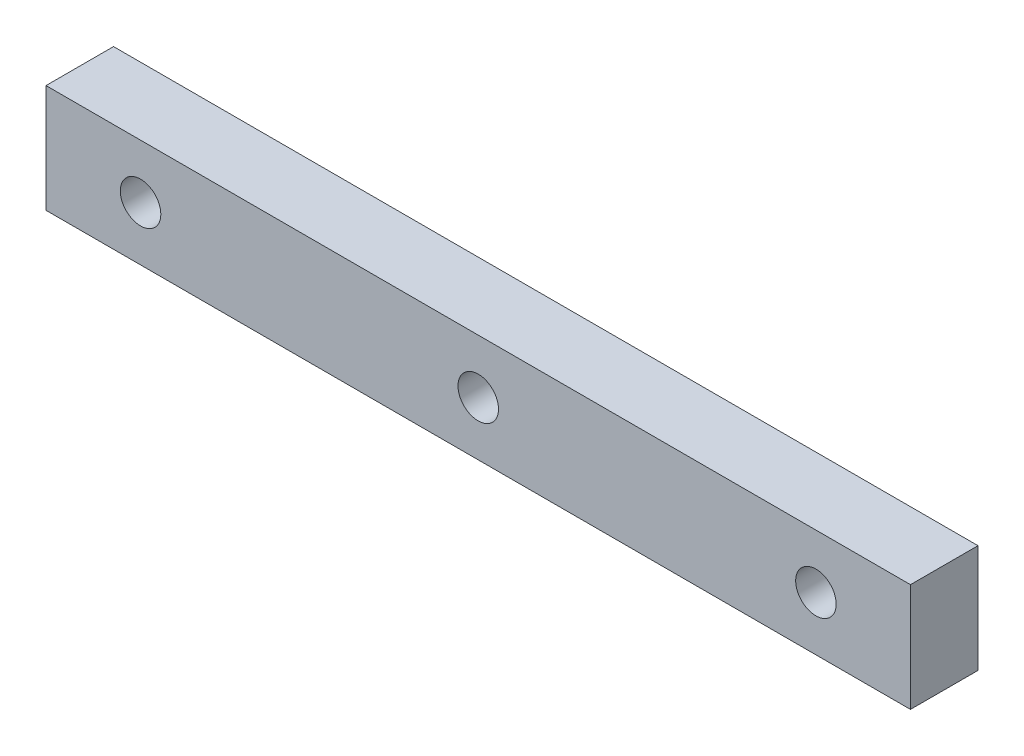
ISO-10303-21;
HEADER;
FILE_DESCRIPTION(('STEP AP214'),'2;1');
FILE_NAME('part.step','',(''),(''),'','','');
FILE_SCHEMA(('AUTOMOTIVE_DESIGN { 1 0 10303 214 1 1 1 1 }'));
ENDSEC;
DATA;
#1=APPLICATION_CONTEXT('core data for automotive mechanical design processes');
#2=APPLICATION_PROTOCOL_DEFINITION('international standard','automotive_design',2000,#1);
#3=PRODUCT_CONTEXT('',#1,'mechanical');
#4=PRODUCT('Part','Part','',(#3));
#5=PRODUCT_RELATED_PRODUCT_CATEGORY('part','',(#4));
#6=PRODUCT_DEFINITION_FORMATION('','',#4);
#7=PRODUCT_DEFINITION_CONTEXT('part definition',#1,'design');
#8=PRODUCT_DEFINITION('design','',#6,#7);
#9=PRODUCT_DEFINITION_SHAPE('','',#8);
#10=(LENGTH_UNIT() NAMED_UNIT(*) SI_UNIT(.MILLI.,.METRE.));
#11=(NAMED_UNIT(*) PLANE_ANGLE_UNIT() SI_UNIT($,.RADIAN.));
#12=(NAMED_UNIT(*) SI_UNIT($,.STERADIAN.) SOLID_ANGLE_UNIT());
#13=UNCERTAINTY_MEASURE_WITH_UNIT(LENGTH_MEASURE(1.E-05),#10,'distance_accuracy_value','');
#14=(GEOMETRIC_REPRESENTATION_CONTEXT(3) GLOBAL_UNCERTAINTY_ASSIGNED_CONTEXT((#13)) GLOBAL_UNIT_ASSIGNED_CONTEXT((#10,
#11,#12)) REPRESENTATION_CONTEXT('',''));
#15=CARTESIAN_POINT('',(0.,0.,0.));
#16=DIRECTION('',(0.,0.,1.));
#17=DIRECTION('',(1.,0.,0.));
#18=AXIS2_PLACEMENT_3D('',#15,#16,#17);
#19=CARTESIAN_POINT('',(-32.,4.,5.));
#20=DIRECTION('',(1.,0.,0.));
#21=DIRECTION('',(0.,0.,-1.));
#22=AXIS2_PLACEMENT_3D('',#19,#20,#21);
#23=PLANE('',#22);
#24=DIRECTION('',(0.,-1.,0.));
#25=VECTOR('',#24,1.);
#26=CARTESIAN_POINT('',(-32.,4.,0.));
#27=LINE('',#26,#25);
#28=CARTESIAN_POINT('',(-32.,4.,0.));
#29=VERTEX_POINT('',#28);
#30=CARTESIAN_POINT('',(-32.,-4.,0.));
#31=VERTEX_POINT('',#30);
#32=EDGE_CURVE('E95',#29,#31,#27,.T.);
#33=ORIENTED_EDGE('',*,*,#32,.T.);
#34=DIRECTION('',(0.,0.,-1.));
#35=VECTOR('',#34,1.);
#36=CARTESIAN_POINT('',(-32.,-4.,5.));
#37=LINE('',#36,#35);
#38=CARTESIAN_POINT('',(-32.,-4.,5.));
#39=VERTEX_POINT('',#38);
#40=EDGE_CURVE('E11',#39,#31,#37,.T.);
#41=ORIENTED_EDGE('',*,*,#40,.F.);
#42=DIRECTION('',(0.,-1.,0.));
#43=VECTOR('',#42,1.);
#44=CARTESIAN_POINT('',(-32.,4.,5.));
#45=LINE('',#44,#43);
#46=CARTESIAN_POINT('',(-32.,4.,5.));
#47=VERTEX_POINT('',#46);
#48=EDGE_CURVE('E83',#47,#39,#45,.T.);
#49=ORIENTED_EDGE('',*,*,#48,.F.);
#50=DIRECTION('',(0.,0.,-1.));
#51=VECTOR('',#50,1.);
#52=CARTESIAN_POINT('',(-32.,4.,5.));
#53=LINE('',#52,#51);
#54=EDGE_CURVE('E91',#47,#29,#53,.T.);
#55=ORIENTED_EDGE('',*,*,#54,.T.);
#56=EDGE_LOOP('',(#33,#41,#49,#55));
#57=FACE_BOUND('',#56,.T.);
#58=ADVANCED_FACE('F32',(#57),#23,.F.);
#59=CARTESIAN_POINT('',(-32.,-4.,5.));
#60=DIRECTION('',(0.,1.,0.));
#61=DIRECTION('',(0.,0.,1.));
#62=AXIS2_PLACEMENT_3D('',#59,#60,#61);
#63=PLANE('',#62);
#64=DIRECTION('',(1.,0.,0.));
#65=VECTOR('',#64,1.);
#66=CARTESIAN_POINT('',(-32.,-4.,0.));
#67=LINE('',#66,#65);
#68=CARTESIAN_POINT('',(32.,-4.,0.));
#69=VERTEX_POINT('',#68);
#70=EDGE_CURVE('E87',#31,#69,#67,.T.);
#71=ORIENTED_EDGE('',*,*,#70,.T.);
#72=DIRECTION('',(0.,0.,-1.));
#73=VECTOR('',#72,1.);
#74=CARTESIAN_POINT('',(32.,-4.,5.));
#75=LINE('',#74,#73);
#76=CARTESIAN_POINT('',(32.,-4.,5.));
#77=VERTEX_POINT('',#76);
#78=EDGE_CURVE('E40',#77,#69,#75,.T.);
#79=ORIENTED_EDGE('',*,*,#78,.F.);
#80=DIRECTION('',(1.,0.,0.));
#81=VECTOR('',#80,1.);
#82=CARTESIAN_POINT('',(-32.,-4.,5.));
#83=LINE('',#82,#81);
#84=EDGE_CURVE('E78',#39,#77,#83,.T.);
#85=ORIENTED_EDGE('',*,*,#84,.F.);
#86=ORIENTED_EDGE('',*,*,#40,.T.);
#87=EDGE_LOOP('',(#71,#79,#85,#86));
#88=FACE_BOUND('',#87,.T.);
#89=ADVANCED_FACE('F86',(#88),#63,.F.);
#90=CARTESIAN_POINT('',(32.,4.,5.));
#91=DIRECTION('',(-1.,0.,0.));
#92=DIRECTION('',(0.,0.,1.));
#93=AXIS2_PLACEMENT_3D('',#90,#91,#92);
#94=PLANE('',#93);
#95=DIRECTION('',(0.,1.,0.));
#96=VECTOR('',#95,1.);
#97=CARTESIAN_POINT('',(32.,4.,0.));
#98=LINE('',#97,#96);
#99=CARTESIAN_POINT('',(32.,4.,0.));
#100=VERTEX_POINT('',#99);
#101=EDGE_CURVE('E65',#69,#100,#98,.T.);
#102=ORIENTED_EDGE('',*,*,#101,.T.);
#103=DIRECTION('',(0.,0.,-1.));
#104=VECTOR('',#103,1.);
#105=CARTESIAN_POINT('',(32.,4.,5.));
#106=LINE('',#105,#104);
#107=CARTESIAN_POINT('',(32.,4.,5.));
#108=VERTEX_POINT('',#107);
#109=EDGE_CURVE('E88',#108,#100,#106,.T.);
#110=ORIENTED_EDGE('',*,*,#109,.F.);
#111=DIRECTION('',(0.,1.,0.));
#112=VECTOR('',#111,1.);
#113=CARTESIAN_POINT('',(32.,4.,5.));
#114=LINE('',#113,#112);
#115=EDGE_CURVE('E81',#77,#108,#114,.T.);
#116=ORIENTED_EDGE('',*,*,#115,.F.);
#117=ORIENTED_EDGE('',*,*,#78,.T.);
#118=EDGE_LOOP('',(#102,#110,#116,#117));
#119=FACE_BOUND('',#118,.T.);
#120=ADVANCED_FACE('F89',(#119),#94,.F.);
#121=CARTESIAN_POINT('',(-32.,4.,5.));
#122=DIRECTION('',(0.,-1.,0.));
#123=DIRECTION('',(0.,0.,-1.));
#124=AXIS2_PLACEMENT_3D('',#121,#122,#123);
#125=PLANE('',#124);
#126=DIRECTION('',(-1.,0.,0.));
#127=VECTOR('',#126,1.);
#128=CARTESIAN_POINT('',(-32.,4.,0.));
#129=LINE('',#128,#127);
#130=EDGE_CURVE('E71',#100,#29,#129,.T.);
#131=ORIENTED_EDGE('',*,*,#130,.T.);
#132=ORIENTED_EDGE('',*,*,#54,.F.);
#133=DIRECTION('',(-1.,0.,0.));
#134=VECTOR('',#133,1.);
#135=CARTESIAN_POINT('',(-32.,4.,5.));
#136=LINE('',#135,#134);
#137=EDGE_CURVE('E48',#108,#47,#136,.T.);
#138=ORIENTED_EDGE('',*,*,#137,.F.);
#139=ORIENTED_EDGE('',*,*,#109,.T.);
#140=EDGE_LOOP('',(#131,#132,#138,#139));
#141=FACE_BOUND('',#140,.T.);
#142=ADVANCED_FACE('F103',(#141),#125,.F.);
#143=CARTESIAN_POINT('',(0.,0.,5.));
#144=DIRECTION('',(0.,0.,1.));
#145=DIRECTION('',(1.,0.,0.));
#146=AXIS2_PLACEMENT_3D('',#143,#144,#145);
#147=PLANE('',#146);
#148=CARTESIAN_POINT('',(25.,0.,5.));
#149=DIRECTION('',(0.,0.,1.));
#150=DIRECTION('',(1.,0.,0.));
#151=AXIS2_PLACEMENT_3D('',#148,#149,#150);
#152=CIRCLE('',#151,1.5);
#153=CARTESIAN_POINT('',(26.5,0.,5.));
#154=VERTEX_POINT('',#153);
#155=EDGE_CURVE('E98',#154,#154,#152,.T.);
#156=ORIENTED_EDGE('',*,*,#155,.F.);
#157=EDGE_LOOP('',(#156));
#158=FACE_BOUND('',#157,.T.);
#159=CARTESIAN_POINT('',(0.,0.,5.));
#160=DIRECTION('',(0.,0.,1.));
#161=DIRECTION('',(1.,0.,0.));
#162=AXIS2_PLACEMENT_3D('',#159,#160,#161);
#163=CIRCLE('',#162,1.5);
#164=CARTESIAN_POINT('',(1.5,0.,5.));
#165=VERTEX_POINT('',#164);
#166=EDGE_CURVE('E111',#165,#165,#163,.T.);
#167=ORIENTED_EDGE('',*,*,#166,.F.);
#168=EDGE_LOOP('',(#167));
#169=FACE_BOUND('',#168,.T.);
#170=CARTESIAN_POINT('',(-25.,0.,5.));
#171=DIRECTION('',(0.,0.,1.));
#172=DIRECTION('',(1.,0.,0.));
#173=AXIS2_PLACEMENT_3D('',#170,#171,#172);
#174=CIRCLE('',#173,1.5);
#175=CARTESIAN_POINT('',(-23.5,0.,5.));
#176=VERTEX_POINT('',#175);
#177=EDGE_CURVE('E114',#176,#176,#174,.T.);
#178=ORIENTED_EDGE('',*,*,#177,.F.);
#179=EDGE_LOOP('',(#178));
#180=FACE_BOUND('',#179,.T.);
#181=ORIENTED_EDGE('',*,*,#48,.T.);
#182=ORIENTED_EDGE('',*,*,#84,.T.);
#183=ORIENTED_EDGE('',*,*,#115,.T.);
#184=ORIENTED_EDGE('',*,*,#137,.T.);
#185=EDGE_LOOP('',(#181,#182,#183,#184));
#186=FACE_BOUND('',#185,.T.);
#187=ADVANCED_FACE('F79',(#158,#169,#180,#186),#147,.T.);
#188=CARTESIAN_POINT('',(0.,0.,0.));
#189=DIRECTION('',(0.,0.,1.));
#190=DIRECTION('',(1.,0.,0.));
#191=AXIS2_PLACEMENT_3D('',#188,#189,#190);
#192=PLANE('',#191);
#193=CARTESIAN_POINT('',(25.,0.,0.));
#194=DIRECTION('',(0.,0.,-1.));
#195=DIRECTION('',(-1.,0.,0.));
#196=AXIS2_PLACEMENT_3D('',#193,#194,#195);
#197=CIRCLE('',#196,1.5);
#198=CARTESIAN_POINT('',(23.5,0.,0.));
#199=VERTEX_POINT('',#198);
#200=EDGE_CURVE('E117',#199,#199,#197,.T.);
#201=ORIENTED_EDGE('',*,*,#200,.F.);
#202=EDGE_LOOP('',(#201));
#203=FACE_BOUND('',#202,.T.);
#204=CARTESIAN_POINT('',(0.,0.,0.));
#205=DIRECTION('',(0.,0.,-1.));
#206=DIRECTION('',(-1.,0.,0.));
#207=AXIS2_PLACEMENT_3D('',#204,#205,#206);
#208=CIRCLE('',#207,1.5);
#209=CARTESIAN_POINT('',(-1.5,0.,0.));
#210=VERTEX_POINT('',#209);
#211=EDGE_CURVE('E121',#210,#210,#208,.T.);
#212=ORIENTED_EDGE('',*,*,#211,.F.);
#213=EDGE_LOOP('',(#212));
#214=FACE_BOUND('',#213,.T.);
#215=CARTESIAN_POINT('',(-25.,0.,0.));
#216=DIRECTION('',(0.,0.,-1.));
#217=DIRECTION('',(-1.,0.,0.));
#218=AXIS2_PLACEMENT_3D('',#215,#216,#217);
#219=CIRCLE('',#218,1.5);
#220=CARTESIAN_POINT('',(-26.5,0.,0.));
#221=VERTEX_POINT('',#220);
#222=EDGE_CURVE('E118',#221,#221,#219,.T.);
#223=ORIENTED_EDGE('',*,*,#222,.F.);
#224=EDGE_LOOP('',(#223));
#225=FACE_BOUND('',#224,.T.);
#226=ORIENTED_EDGE('',*,*,#32,.F.);
#227=ORIENTED_EDGE('',*,*,#130,.F.);
#228=ORIENTED_EDGE('',*,*,#101,.F.);
#229=ORIENTED_EDGE('',*,*,#70,.F.);
#230=EDGE_LOOP('',(#226,#227,#228,#229));
#231=FACE_BOUND('',#230,.T.);
#232=ADVANCED_FACE('F106',(#203,#214,#225,#231),#192,.F.);
#233=CARTESIAN_POINT('',(-25.,0.,10.));
#234=DIRECTION('',(0.,0.,-1.));
#235=DIRECTION('',(-1.,0.,0.));
#236=AXIS2_PLACEMENT_3D('',#233,#234,#235);
#237=CYLINDRICAL_SURFACE('',#236,1.5);
#238=ORIENTED_EDGE('',*,*,#177,.T.);
#239=EDGE_LOOP('',(#238));
#240=FACE_BOUND('',#239,.T.);
#241=ORIENTED_EDGE('',*,*,#222,.T.);
#242=EDGE_LOOP('',(#241));
#243=FACE_BOUND('',#242,.T.);
#244=ADVANCED_FACE('F131',(#240,#243),#237,.F.);
#245=CARTESIAN_POINT('',(0.,0.,10.));
#246=DIRECTION('',(0.,0.,-1.));
#247=DIRECTION('',(-1.,0.,0.));
#248=AXIS2_PLACEMENT_3D('',#245,#246,#247);
#249=CYLINDRICAL_SURFACE('',#248,1.5);
#250=ORIENTED_EDGE('',*,*,#166,.T.);
#251=EDGE_LOOP('',(#250));
#252=FACE_BOUND('',#251,.T.);
#253=ORIENTED_EDGE('',*,*,#211,.T.);
#254=EDGE_LOOP('',(#253));
#255=FACE_BOUND('',#254,.T.);
#256=ADVANCED_FACE('F138',(#252,#255),#249,.F.);
#257=CARTESIAN_POINT('',(25.,0.,10.));
#258=DIRECTION('',(0.,0.,-1.));
#259=DIRECTION('',(-1.,0.,0.));
#260=AXIS2_PLACEMENT_3D('',#257,#258,#259);
#261=CYLINDRICAL_SURFACE('',#260,1.5);
#262=ORIENTED_EDGE('',*,*,#155,.T.);
#263=EDGE_LOOP('',(#262));
#264=FACE_BOUND('',#263,.T.);
#265=ORIENTED_EDGE('',*,*,#200,.T.);
#266=EDGE_LOOP('',(#265));
#267=FACE_BOUND('',#266,.T.);
#268=ADVANCED_FACE('F127',(#264,#267),#261,.F.);
#269=CLOSED_SHELL('',(#58,#89,#120,#142,#187,#232,#244,#256,#268));
#270=MANIFOLD_SOLID_BREP('B2',#269);
#271=ADVANCED_BREP_SHAPE_REPRESENTATION('',(#18,#270),#14);
#272=SHAPE_DEFINITION_REPRESENTATION(#9,#271);
ENDSEC;
END-ISO-10303-21;
